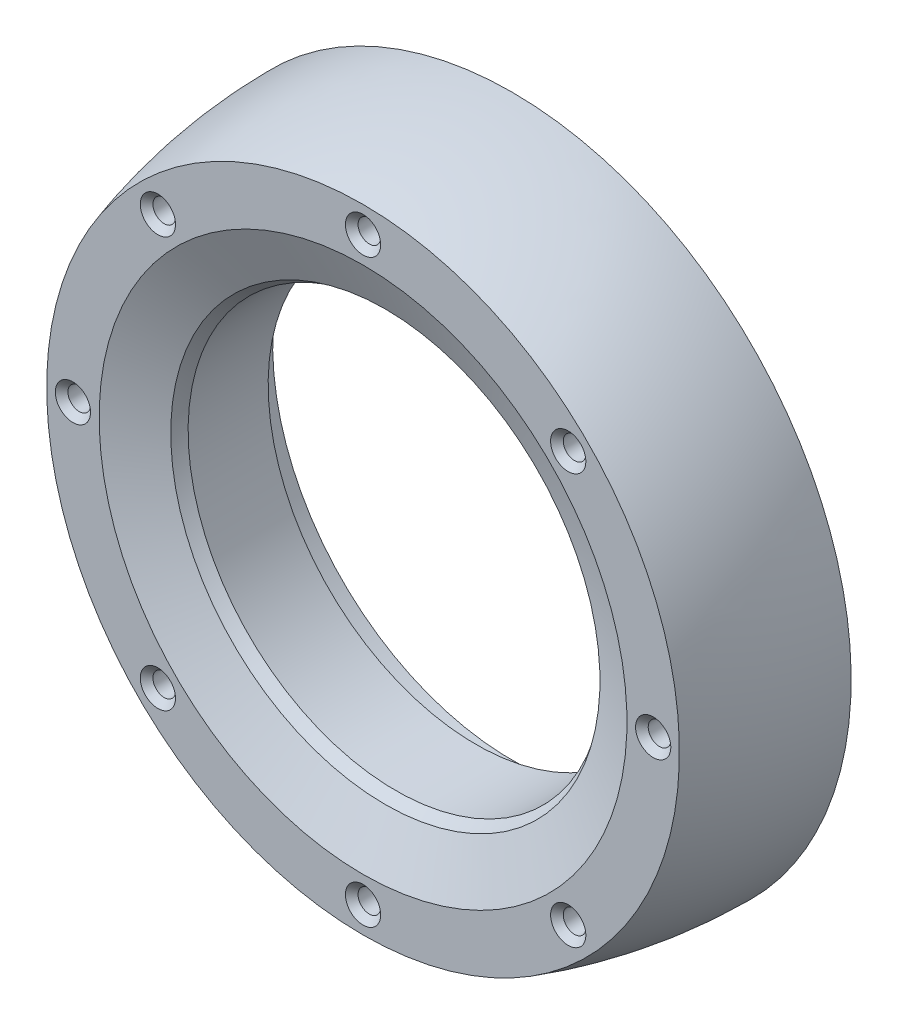
ISO-10303-21;
HEADER;
FILE_DESCRIPTION(('STEP AP214'),'2;1');
FILE_NAME('part.step','',(''),(''),'','','');
FILE_SCHEMA(('AUTOMOTIVE_DESIGN { 1 0 10303 214 1 1 1 1 }'));
ENDSEC;
DATA;
#1=APPLICATION_CONTEXT('core data for automotive mechanical design processes');
#2=APPLICATION_PROTOCOL_DEFINITION('international standard','automotive_design',2000,#1);
#3=PRODUCT_CONTEXT('',#1,'mechanical');
#4=PRODUCT('Part','Part','',(#3));
#5=PRODUCT_RELATED_PRODUCT_CATEGORY('part','',(#4));
#6=PRODUCT_DEFINITION_FORMATION('','',#4);
#7=PRODUCT_DEFINITION_CONTEXT('part definition',#1,'design');
#8=PRODUCT_DEFINITION('design','',#6,#7);
#9=PRODUCT_DEFINITION_SHAPE('','',#8);
#10=(LENGTH_UNIT() NAMED_UNIT(*) SI_UNIT(.MILLI.,.METRE.));
#11=(NAMED_UNIT(*) PLANE_ANGLE_UNIT() SI_UNIT($,.RADIAN.));
#12=(NAMED_UNIT(*) SI_UNIT($,.STERADIAN.) SOLID_ANGLE_UNIT());
#13=UNCERTAINTY_MEASURE_WITH_UNIT(LENGTH_MEASURE(1.E-05),#10,'distance_accuracy_value','');
#14=(GEOMETRIC_REPRESENTATION_CONTEXT(3) GLOBAL_UNCERTAINTY_ASSIGNED_CONTEXT((#13)) GLOBAL_UNIT_ASSIGNED_CONTEXT((#10,
#11,#12)) REPRESENTATION_CONTEXT('',''));
#15=CARTESIAN_POINT('',(0.,0.,0.));
#16=DIRECTION('',(0.,0.,1.));
#17=DIRECTION('',(1.,0.,0.));
#18=AXIS2_PLACEMENT_3D('',#15,#16,#17);
#19=CARTESIAN_POINT('',(0.,0.,16.5));
#20=DIRECTION('',(0.,0.,1.));
#21=DIRECTION('',(0.,-1.,0.));
#22=AXIS2_PLACEMENT_3D('',#19,#20,#21);
#23=PLANE('',#22);
#24=CARTESIAN_POINT('',(0.,-32.0981570979085,16.5));
#25=DIRECTION('',(0.,0.,1.));
#26=DIRECTION('',(1.,0.,0.));
#27=AXIS2_PLACEMENT_3D('',#24,#25,#26);
#28=CIRCLE('',#27,1.95);
#29=CARTESIAN_POINT('',(1.95,-32.0981570979085,16.5));
#30=VERTEX_POINT('',#29);
#31=EDGE_CURVE('E54',#30,#30,#28,.T.);
#32=ORIENTED_EDGE('',*,*,#31,.F.);
#33=EDGE_LOOP('',(#32));
#34=FACE_BOUND('',#33,.T.);
#35=CARTESIAN_POINT('',(-22.6968245475223,-22.6968245475222,16.5));
#36=DIRECTION('',(0.,0.,1.));
#37=DIRECTION('',(1.,0.,0.));
#38=AXIS2_PLACEMENT_3D('',#35,#36,#37);
#39=CIRCLE('',#38,1.95);
#40=CARTESIAN_POINT('',(-20.7468245475223,-22.6968245475222,16.5));
#41=VERTEX_POINT('',#40);
#42=EDGE_CURVE('E102',#41,#41,#39,.T.);
#43=ORIENTED_EDGE('',*,*,#42,.F.);
#44=EDGE_LOOP('',(#43));
#45=FACE_BOUND('',#44,.T.);
#46=CARTESIAN_POINT('',(-32.0981570979085,0.,16.5));
#47=DIRECTION('',(0.,0.,1.));
#48=DIRECTION('',(1.,0.,0.));
#49=AXIS2_PLACEMENT_3D('',#46,#47,#48);
#50=CIRCLE('',#49,1.95);
#51=CARTESIAN_POINT('',(-30.1481570979085,0.,16.5));
#52=VERTEX_POINT('',#51);
#53=EDGE_CURVE('E105',#52,#52,#50,.T.);
#54=ORIENTED_EDGE('',*,*,#53,.F.);
#55=EDGE_LOOP('',(#54));
#56=FACE_BOUND('',#55,.T.);
#57=CARTESIAN_POINT('',(-22.6968245475222,22.6968245475222,16.5));
#58=DIRECTION('',(0.,0.,1.));
#59=DIRECTION('',(1.,0.,0.));
#60=AXIS2_PLACEMENT_3D('',#57,#58,#59);
#61=CIRCLE('',#60,1.95);
#62=CARTESIAN_POINT('',(-20.7468245475222,22.6968245475222,16.5));
#63=VERTEX_POINT('',#62);
#64=EDGE_CURVE('E108',#63,#63,#61,.T.);
#65=ORIENTED_EDGE('',*,*,#64,.F.);
#66=EDGE_LOOP('',(#65));
#67=FACE_BOUND('',#66,.T.);
#68=CARTESIAN_POINT('',(0.,32.0981570979085,16.5));
#69=DIRECTION('',(0.,0.,1.));
#70=DIRECTION('',(1.,0.,0.));
#71=AXIS2_PLACEMENT_3D('',#68,#69,#70);
#72=CIRCLE('',#71,1.95);
#73=CARTESIAN_POINT('',(1.95,32.0981570979085,16.5));
#74=VERTEX_POINT('',#73);
#75=EDGE_CURVE('E111',#74,#74,#72,.T.);
#76=ORIENTED_EDGE('',*,*,#75,.F.);
#77=EDGE_LOOP('',(#76));
#78=FACE_BOUND('',#77,.T.);
#79=CARTESIAN_POINT('',(22.6968245475223,22.6968245475222,16.5));
#80=DIRECTION('',(0.,0.,1.));
#81=DIRECTION('',(1.,0.,0.));
#82=AXIS2_PLACEMENT_3D('',#79,#80,#81);
#83=CIRCLE('',#82,1.95);
#84=CARTESIAN_POINT('',(24.6468245475223,22.6968245475222,16.5));
#85=VERTEX_POINT('',#84);
#86=EDGE_CURVE('E114',#85,#85,#83,.T.);
#87=ORIENTED_EDGE('',*,*,#86,.F.);
#88=EDGE_LOOP('',(#87));
#89=FACE_BOUND('',#88,.T.);
#90=CARTESIAN_POINT('',(32.0981570979085,0.,16.5));
#91=DIRECTION('',(0.,0.,1.));
#92=DIRECTION('',(1.,0.,0.));
#93=AXIS2_PLACEMENT_3D('',#90,#91,#92);
#94=CIRCLE('',#93,1.95);
#95=CARTESIAN_POINT('',(34.0481570979085,0.,16.5));
#96=VERTEX_POINT('',#95);
#97=EDGE_CURVE('E117',#96,#96,#94,.T.);
#98=ORIENTED_EDGE('',*,*,#97,.F.);
#99=EDGE_LOOP('',(#98));
#100=FACE_BOUND('',#99,.T.);
#101=CARTESIAN_POINT('',(22.6968245475222,-22.6968245475223,16.5));
#102=DIRECTION('',(0.,0.,1.));
#103=DIRECTION('',(1.,0.,0.));
#104=AXIS2_PLACEMENT_3D('',#101,#102,#103);
#105=CIRCLE('',#104,1.95);
#106=CARTESIAN_POINT('',(24.6468245475222,-22.6968245475223,16.5));
#107=VERTEX_POINT('',#106);
#108=EDGE_CURVE('E120',#107,#107,#105,.T.);
#109=ORIENTED_EDGE('',*,*,#108,.F.);
#110=EDGE_LOOP('',(#109));
#111=FACE_BOUND('',#110,.T.);
#112=CARTESIAN_POINT('',(0.,0.,16.5));
#113=DIRECTION('',(0.,0.,1.));
#114=DIRECTION('',(0.,-1.,0.));
#115=AXIS2_PLACEMENT_3D('',#112,#113,#114);
#116=CIRCLE('',#115,29.196314195817);
#117=CARTESIAN_POINT('',(0.,-29.196314195817,16.5));
#118=VERTEX_POINT('',#117);
#119=EDGE_CURVE('E42',#118,#118,#116,.F.);
#120=ORIENTED_EDGE('',*,*,#119,.T.);
#121=EDGE_LOOP('',(#120));
#122=FACE_BOUND('',#121,.T.);
#123=CARTESIAN_POINT('',(0.,0.,16.5));
#124=DIRECTION('',(0.,0.,-1.));
#125=DIRECTION('',(0.,1.,0.));
#126=AXIS2_PLACEMENT_3D('',#123,#124,#125);
#127=CIRCLE('',#126,35.);
#128=CARTESIAN_POINT('',(0.,35.,16.5));
#129=VERTEX_POINT('',#128);
#130=EDGE_CURVE('E135',#129,#129,#127,.T.);
#131=ORIENTED_EDGE('',*,*,#130,.F.);
#132=EDGE_LOOP('',(#131));
#133=FACE_BOUND('',#132,.T.);
#134=ADVANCED_FACE('F34',(#34,#45,#56,#67,#78,#89,#100,#111,#122,#133),#23,.T.);
#135=CARTESIAN_POINT('',(0.,0.,22.5));
#136=DIRECTION('',(0.,0.,-1.));
#137=DIRECTION('',(0.,1.,0.));
#138=AXIS2_PLACEMENT_3D('',#135,#136,#137);
#139=DEGENERATE_TOROIDAL_SURFACE('',#138,9.,17.,.T.);
#140=CARTESIAN_POINT('',(0.,0.,12.8563492390071));
#141=DIRECTION('',(0.,0.,-1.));
#142=DIRECTION('',(0.,1.,0.));
#143=AXIS2_PLACEMENT_3D('',#140,#141,#142);
#144=CIRCLE('',#143,23.);
#145=CARTESIAN_POINT('',(0.,23.,12.8563492390071));
#146=VERTEX_POINT('',#145);
#147=EDGE_CURVE('E126',#146,#146,#144,.T.);
#148=ORIENTED_EDGE('',*,*,#147,.T.);
#149=EDGE_LOOP('',(#148));
#150=FACE_BOUND('',#149,.T.);
#151=CARTESIAN_POINT('',(0.,0.,14.0333791781715));
#152=DIRECTION('',(0.,0.,1.));
#153=DIRECTION('',(0.,-1.,0.));
#154=AXIS2_PLACEMENT_3D('',#151,#152,#153);
#155=CIRCLE('',#154,23.7416529554653);
#156=CARTESIAN_POINT('',(0.,-23.7416529554653,14.0333791781715));
#157=VERTEX_POINT('',#156);
#158=EDGE_CURVE('E10',#157,#157,#155,.T.);
#159=ORIENTED_EDGE('',*,*,#158,.T.);
#160=EDGE_LOOP('',(#159));
#161=FACE_BOUND('',#160,.T.);
#162=ADVANCED_FACE('F152',(#150,#161),#139,.F.);
#163=CARTESIAN_POINT('',(0.,0.,0.));
#164=DIRECTION('',(0.,0.,-1.));
#165=DIRECTION('',(0.,1.,0.));
#166=AXIS2_PLACEMENT_3D('',#163,#164,#165);
#167=PLANE('',#166);
#168=CARTESIAN_POINT('',(-22.6968245475223,-22.6968245475222,0.));
#169=DIRECTION('',(0.,0.,-1.));
#170=DIRECTION('',(0.,1.,0.));
#171=AXIS2_PLACEMENT_3D('',#168,#169,#170);
#172=CIRCLE('',#171,1.25);
#173=CARTESIAN_POINT('',(-22.6968245475223,-21.4468245475222,0.));
#174=VERTEX_POINT('',#173);
#175=EDGE_CURVE('E87',#174,#174,#172,.T.);
#176=ORIENTED_EDGE('',*,*,#175,.F.);
#177=EDGE_LOOP('',(#176));
#178=FACE_BOUND('',#177,.T.);
#179=CARTESIAN_POINT('',(0.,-32.0981570979085,0.));
#180=DIRECTION('',(0.,0.,-1.));
#181=DIRECTION('',(0.,1.,0.));
#182=AXIS2_PLACEMENT_3D('',#179,#180,#181);
#183=CIRCLE('',#182,1.25);
#184=CARTESIAN_POINT('',(0.,-30.8481570979085,0.));
#185=VERTEX_POINT('',#184);
#186=EDGE_CURVE('E77',#185,#185,#183,.T.);
#187=ORIENTED_EDGE('',*,*,#186,.F.);
#188=EDGE_LOOP('',(#187));
#189=FACE_BOUND('',#188,.T.);
#190=CARTESIAN_POINT('',(22.6968245475222,-22.6968245475223,0.));
#191=DIRECTION('',(0.,0.,-1.));
#192=DIRECTION('',(0.,1.,0.));
#193=AXIS2_PLACEMENT_3D('',#190,#191,#192);
#194=CIRCLE('',#193,1.25);
#195=CARTESIAN_POINT('',(22.6968245475222,-21.4468245475223,0.));
#196=VERTEX_POINT('',#195);
#197=EDGE_CURVE('E74',#196,#196,#194,.T.);
#198=ORIENTED_EDGE('',*,*,#197,.F.);
#199=EDGE_LOOP('',(#198));
#200=FACE_BOUND('',#199,.T.);
#201=CARTESIAN_POINT('',(32.0981570979085,0.,0.));
#202=DIRECTION('',(0.,0.,-1.));
#203=DIRECTION('',(0.,1.,0.));
#204=AXIS2_PLACEMENT_3D('',#201,#202,#203);
#205=CIRCLE('',#204,1.25);
#206=CARTESIAN_POINT('',(32.0981570979085,1.25,0.));
#207=VERTEX_POINT('',#206);
#208=EDGE_CURVE('E71',#207,#207,#205,.T.);
#209=ORIENTED_EDGE('',*,*,#208,.F.);
#210=EDGE_LOOP('',(#209));
#211=FACE_BOUND('',#210,.T.);
#212=CARTESIAN_POINT('',(22.6968245475223,22.6968245475222,0.));
#213=DIRECTION('',(0.,0.,-1.));
#214=DIRECTION('',(0.,1.,0.));
#215=AXIS2_PLACEMENT_3D('',#212,#213,#214);
#216=CIRCLE('',#215,1.25);
#217=CARTESIAN_POINT('',(22.6968245475223,23.9468245475222,0.));
#218=VERTEX_POINT('',#217);
#219=EDGE_CURVE('E67',#218,#218,#216,.T.);
#220=ORIENTED_EDGE('',*,*,#219,.F.);
#221=EDGE_LOOP('',(#220));
#222=FACE_BOUND('',#221,.T.);
#223=CARTESIAN_POINT('',(-32.0981570979085,0.,0.));
#224=DIRECTION('',(0.,0.,-1.));
#225=DIRECTION('',(0.,1.,0.));
#226=AXIS2_PLACEMENT_3D('',#223,#224,#225);
#227=CIRCLE('',#226,1.25);
#228=CARTESIAN_POINT('',(-32.0981570979085,1.25,0.));
#229=VERTEX_POINT('',#228);
#230=EDGE_CURVE('E63',#229,#229,#227,.T.);
#231=ORIENTED_EDGE('',*,*,#230,.F.);
#232=EDGE_LOOP('',(#231));
#233=FACE_BOUND('',#232,.T.);
#234=CARTESIAN_POINT('',(-22.6968245475222,22.6968245475222,0.));
#235=DIRECTION('',(0.,0.,-1.));
#236=DIRECTION('',(0.,1.,0.));
#237=AXIS2_PLACEMENT_3D('',#234,#235,#236);
#238=CIRCLE('',#237,1.25);
#239=CARTESIAN_POINT('',(-22.6968245475222,23.9468245475222,0.));
#240=VERTEX_POINT('',#239);
#241=EDGE_CURVE('E59',#240,#240,#238,.T.);
#242=ORIENTED_EDGE('',*,*,#241,.F.);
#243=EDGE_LOOP('',(#242));
#244=FACE_BOUND('',#243,.T.);
#245=CARTESIAN_POINT('',(0.,32.0981570979085,0.));
#246=DIRECTION('',(0.,0.,-1.));
#247=DIRECTION('',(0.,1.,0.));
#248=AXIS2_PLACEMENT_3D('',#245,#246,#247);
#249=CIRCLE('',#248,1.25);
#250=CARTESIAN_POINT('',(0.,33.3481570979085,0.));
#251=VERTEX_POINT('',#250);
#252=EDGE_CURVE('E55',#251,#251,#249,.T.);
#253=ORIENTED_EDGE('',*,*,#252,.F.);
#254=EDGE_LOOP('',(#253));
#255=FACE_BOUND('',#254,.T.);
#256=CARTESIAN_POINT('',(0.,0.,0.));
#257=DIRECTION('',(0.,0.,-1.));
#258=DIRECTION('',(0.,1.,0.));
#259=AXIS2_PLACEMENT_3D('',#256,#257,#258);
#260=CIRCLE('',#259,26.5);
#261=CARTESIAN_POINT('',(0.,26.5,0.));
#262=VERTEX_POINT('',#261);
#263=EDGE_CURVE('E129',#262,#262,#260,.T.);
#264=ORIENTED_EDGE('',*,*,#263,.F.);
#265=EDGE_LOOP('',(#264));
#266=FACE_BOUND('',#265,.T.);
#267=CARTESIAN_POINT('',(0.,0.,0.));
#268=DIRECTION('',(0.,0.,-1.));
#269=DIRECTION('',(0.,1.,0.));
#270=AXIS2_PLACEMENT_3D('',#267,#268,#269);
#271=CIRCLE('',#270,37.5);
#272=CARTESIAN_POINT('',(0.,37.5,0.));
#273=VERTEX_POINT('',#272);
#274=EDGE_CURVE('E47',#273,#273,#271,.T.);
#275=ORIENTED_EDGE('',*,*,#274,.T.);
#276=EDGE_LOOP('',(#275));
#277=FACE_BOUND('',#276,.T.);
#278=ADVANCED_FACE('F140',(#178,#189,#200,#211,#222,#233,#244,#255,#266,#277),#167,.T.);
#279=CARTESIAN_POINT('',(0.,0.,0.));
#280=DIRECTION('',(0.,0.,-1.));
#281=DIRECTION('',(0.,1.,0.));
#282=AXIS2_PLACEMENT_3D('',#279,#280,#281);
#283=DEGENERATE_TOROIDAL_SURFACE('',#282,18.2000000000001,55.7000000000001,.F.);
#284=ORIENTED_EDGE('',*,*,#130,.T.);
#285=EDGE_LOOP('',(#284));
#286=FACE_BOUND('',#285,.T.);
#287=ORIENTED_EDGE('',*,*,#274,.F.);
#288=EDGE_LOOP('',(#287));
#289=FACE_BOUND('',#288,.T.);
#290=ADVANCED_FACE('F142',(#286,#289),#283,.F.);
#291=CARTESIAN_POINT('',(0.,0.,16.5));
#292=DIRECTION('',(0.,0.,1.));
#293=DIRECTION('',(0.,-1.,0.));
#294=AXIS2_PLACEMENT_3D('',#291,#292,#293);
#295=CONICAL_SURFACE('',#294,29.196314195817,1.14611088376097);
#296=ORIENTED_EDGE('',*,*,#158,.F.);
#297=EDGE_LOOP('',(#296));
#298=FACE_BOUND('',#297,.T.);
#299=ORIENTED_EDGE('',*,*,#119,.F.);
#300=EDGE_LOOP('',(#299));
#301=FACE_BOUND('',#300,.T.);
#302=ADVANCED_FACE('F36',(#298,#301),#295,.F.);
#303=CARTESIAN_POINT('',(0.,0.,-11.0117281202219));
#304=DIRECTION('',(0.,0.,-1.));
#305=DIRECTION('',(0.,1.,0.));
#306=AXIS2_PLACEMENT_3D('',#303,#304,#305);
#307=CYLINDRICAL_SURFACE('',#306,26.5);
#308=CARTESIAN_POINT('',(0.,0.,3.99999999999999));
#309=DIRECTION('',(0.,0.,-1.));
#310=DIRECTION('',(0.,1.,0.));
#311=AXIS2_PLACEMENT_3D('',#308,#309,#310);
#312=CIRCLE('',#311,26.5);
#313=CARTESIAN_POINT('',(0.,26.5,3.99999999999999));
#314=VERTEX_POINT('',#313);
#315=EDGE_CURVE('E132',#314,#314,#312,.T.);
#316=ORIENTED_EDGE('',*,*,#315,.F.);
#317=EDGE_LOOP('',(#316));
#318=FACE_BOUND('',#317,.T.);
#319=ORIENTED_EDGE('',*,*,#263,.T.);
#320=EDGE_LOOP('',(#319));
#321=FACE_BOUND('',#320,.T.);
#322=ADVANCED_FACE('F150',(#318,#321),#307,.F.);
#323=CARTESIAN_POINT('',(0.,0.,4.));
#324=DIRECTION('',(0.,0.,1.));
#325=DIRECTION('',(0.,-1.,0.));
#326=AXIS2_PLACEMENT_3D('',#323,#324,#325);
#327=PLANE('',#326);
#328=CARTESIAN_POINT('',(0.,0.,3.99999999999999));
#329=DIRECTION('',(0.,0.,-1.));
#330=DIRECTION('',(0.,1.,0.));
#331=AXIS2_PLACEMENT_3D('',#328,#329,#330);
#332=CIRCLE('',#331,23.);
#333=CARTESIAN_POINT('',(0.,23.,3.99999999999999));
#334=VERTEX_POINT('',#333);
#335=EDGE_CURVE('E123',#334,#334,#332,.T.);
#336=ORIENTED_EDGE('',*,*,#335,.F.);
#337=EDGE_LOOP('',(#336));
#338=FACE_BOUND('',#337,.T.);
#339=ORIENTED_EDGE('',*,*,#315,.T.);
#340=EDGE_LOOP('',(#339));
#341=FACE_BOUND('',#340,.T.);
#342=ADVANCED_FACE('F166',(#338,#341),#327,.F.);
#343=CARTESIAN_POINT('',(0.,0.,-11.0117281202219));
#344=DIRECTION('',(0.,0.,-1.));
#345=DIRECTION('',(0.,1.,0.));
#346=AXIS2_PLACEMENT_3D('',#343,#344,#345);
#347=CYLINDRICAL_SURFACE('',#346,23.);
#348=ORIENTED_EDGE('',*,*,#147,.F.);
#349=EDGE_LOOP('',(#348));
#350=FACE_BOUND('',#349,.T.);
#351=ORIENTED_EDGE('',*,*,#335,.T.);
#352=EDGE_LOOP('',(#351));
#353=FACE_BOUND('',#352,.T.);
#354=ADVANCED_FACE('F168',(#350,#353),#347,.F.);
#355=CARTESIAN_POINT('',(22.6968245475222,-22.6968245475223,16.5));
#356=DIRECTION('',(0.,0.,1.));
#357=DIRECTION('',(1.,0.,0.));
#358=AXIS2_PLACEMENT_3D('',#355,#356,#357);
#359=CONICAL_SURFACE('',#358,1.95,0.785398163397448);
#360=CARTESIAN_POINT('',(22.6968245475222,-22.6968245475223,15.8));
#361=DIRECTION('',(0.,0.,1.));
#362=DIRECTION('',(1.,0.,0.));
#363=AXIS2_PLACEMENT_3D('',#360,#361,#362);
#364=CIRCLE('',#363,1.25);
#365=CARTESIAN_POINT('',(23.9468245475222,-22.6968245475223,15.8));
#366=VERTEX_POINT('',#365);
#367=EDGE_CURVE('E72',#366,#366,#364,.F.);
#368=ORIENTED_EDGE('',*,*,#367,.T.);
#369=EDGE_LOOP('',(#368));
#370=FACE_BOUND('',#369,.T.);
#371=ORIENTED_EDGE('',*,*,#108,.T.);
#372=EDGE_LOOP('',(#371));
#373=FACE_BOUND('',#372,.T.);
#374=ADVANCED_FACE('F174',(#370,#373),#359,.F.);
#375=CARTESIAN_POINT('',(32.0981570979085,0.,16.5));
#376=DIRECTION('',(0.,0.,1.));
#377=DIRECTION('',(1.,0.,0.));
#378=AXIS2_PLACEMENT_3D('',#375,#376,#377);
#379=CONICAL_SURFACE('',#378,1.95,0.78539816339745);
#380=CARTESIAN_POINT('',(32.0981570979085,0.,15.8));
#381=DIRECTION('',(0.,0.,1.));
#382=DIRECTION('',(1.,0.,0.));
#383=AXIS2_PLACEMENT_3D('',#380,#381,#382);
#384=CIRCLE('',#383,1.25);
#385=CARTESIAN_POINT('',(33.3481570979085,0.,15.8));
#386=VERTEX_POINT('',#385);
#387=EDGE_CURVE('E68',#386,#386,#384,.F.);
#388=ORIENTED_EDGE('',*,*,#387,.T.);
#389=EDGE_LOOP('',(#388));
#390=FACE_BOUND('',#389,.T.);
#391=ORIENTED_EDGE('',*,*,#97,.T.);
#392=EDGE_LOOP('',(#391));
#393=FACE_BOUND('',#392,.T.);
#394=ADVANCED_FACE('F190',(#390,#393),#379,.F.);
#395=CARTESIAN_POINT('',(22.6968245475223,22.6968245475222,16.5));
#396=DIRECTION('',(0.,0.,1.));
#397=DIRECTION('',(1.,0.,0.));
#398=AXIS2_PLACEMENT_3D('',#395,#396,#397);
#399=CONICAL_SURFACE('',#398,1.95,0.785398163397448);
#400=CARTESIAN_POINT('',(22.6968245475223,22.6968245475222,15.8));
#401=DIRECTION('',(0.,0.,1.));
#402=DIRECTION('',(1.,0.,0.));
#403=AXIS2_PLACEMENT_3D('',#400,#401,#402);
#404=CIRCLE('',#403,1.25);
#405=CARTESIAN_POINT('',(23.9468245475223,22.6968245475222,15.8));
#406=VERTEX_POINT('',#405);
#407=EDGE_CURVE('E64',#406,#406,#404,.F.);
#408=ORIENTED_EDGE('',*,*,#407,.T.);
#409=EDGE_LOOP('',(#408));
#410=FACE_BOUND('',#409,.T.);
#411=ORIENTED_EDGE('',*,*,#86,.T.);
#412=EDGE_LOOP('',(#411));
#413=FACE_BOUND('',#412,.T.);
#414=ADVANCED_FACE('F194',(#410,#413),#399,.F.);
#415=CARTESIAN_POINT('',(0.,32.0981570979085,16.5));
#416=DIRECTION('',(0.,0.,1.));
#417=DIRECTION('',(1.,0.,0.));
#418=AXIS2_PLACEMENT_3D('',#415,#416,#417);
#419=CONICAL_SURFACE('',#418,1.95,0.785398163397449);
#420=CARTESIAN_POINT('',(0.,32.0981570979085,15.8));
#421=DIRECTION('',(0.,0.,1.));
#422=DIRECTION('',(1.,0.,0.));
#423=AXIS2_PLACEMENT_3D('',#420,#421,#422);
#424=CIRCLE('',#423,1.25);
#425=CARTESIAN_POINT('',(1.25,32.0981570979085,15.8));
#426=VERTEX_POINT('',#425);
#427=EDGE_CURVE('E51',#426,#426,#424,.F.);
#428=ORIENTED_EDGE('',*,*,#427,.T.);
#429=EDGE_LOOP('',(#428));
#430=FACE_BOUND('',#429,.T.);
#431=ORIENTED_EDGE('',*,*,#75,.T.);
#432=EDGE_LOOP('',(#431));
#433=FACE_BOUND('',#432,.T.);
#434=ADVANCED_FACE('F198',(#430,#433),#419,.F.);
#435=CARTESIAN_POINT('',(-22.6968245475222,22.6968245475222,16.5));
#436=DIRECTION('',(0.,0.,1.));
#437=DIRECTION('',(1.,0.,0.));
#438=AXIS2_PLACEMENT_3D('',#435,#436,#437);
#439=CONICAL_SURFACE('',#438,1.95,0.785398163397448);
#440=CARTESIAN_POINT('',(-22.6968245475222,22.6968245475222,15.8));
#441=DIRECTION('',(0.,0.,1.));
#442=DIRECTION('',(1.,0.,0.));
#443=AXIS2_PLACEMENT_3D('',#440,#441,#442);
#444=CIRCLE('',#443,1.25);
#445=CARTESIAN_POINT('',(-21.4468245475222,22.6968245475222,15.8));
#446=VERTEX_POINT('',#445);
#447=EDGE_CURVE('E56',#446,#446,#444,.F.);
#448=ORIENTED_EDGE('',*,*,#447,.T.);
#449=EDGE_LOOP('',(#448));
#450=FACE_BOUND('',#449,.T.);
#451=ORIENTED_EDGE('',*,*,#64,.T.);
#452=EDGE_LOOP('',(#451));
#453=FACE_BOUND('',#452,.T.);
#454=ADVANCED_FACE('F202',(#450,#453),#439,.F.);
#455=CARTESIAN_POINT('',(-32.0981570979085,0.,16.5));
#456=DIRECTION('',(0.,0.,1.));
#457=DIRECTION('',(1.,0.,0.));
#458=AXIS2_PLACEMENT_3D('',#455,#456,#457);
#459=CONICAL_SURFACE('',#458,1.95,0.78539816339745);
#460=CARTESIAN_POINT('',(-32.0981570979085,0.,15.8));
#461=DIRECTION('',(0.,0.,1.));
#462=DIRECTION('',(1.,0.,0.));
#463=AXIS2_PLACEMENT_3D('',#460,#461,#462);
#464=CIRCLE('',#463,1.25);
#465=CARTESIAN_POINT('',(-30.8481570979085,0.,15.8));
#466=VERTEX_POINT('',#465);
#467=EDGE_CURVE('E60',#466,#466,#464,.F.);
#468=ORIENTED_EDGE('',*,*,#467,.T.);
#469=EDGE_LOOP('',(#468));
#470=FACE_BOUND('',#469,.T.);
#471=ORIENTED_EDGE('',*,*,#53,.T.);
#472=EDGE_LOOP('',(#471));
#473=FACE_BOUND('',#472,.T.);
#474=ADVANCED_FACE('F206',(#470,#473),#459,.F.);
#475=CARTESIAN_POINT('',(-22.6968245475223,-22.6968245475222,16.5));
#476=DIRECTION('',(0.,0.,1.));
#477=DIRECTION('',(1.,0.,0.));
#478=AXIS2_PLACEMENT_3D('',#475,#476,#477);
#479=CONICAL_SURFACE('',#478,1.95,0.785398163397448);
#480=CARTESIAN_POINT('',(-22.6968245475223,-22.6968245475222,15.8));
#481=DIRECTION('',(0.,0.,1.));
#482=DIRECTION('',(1.,0.,0.));
#483=AXIS2_PLACEMENT_3D('',#480,#481,#482);
#484=CIRCLE('',#483,1.25);
#485=CARTESIAN_POINT('',(-21.4468245475223,-22.6968245475222,15.8));
#486=VERTEX_POINT('',#485);
#487=EDGE_CURVE('E38',#486,#486,#484,.F.);
#488=ORIENTED_EDGE('',*,*,#487,.T.);
#489=EDGE_LOOP('',(#488));
#490=FACE_BOUND('',#489,.T.);
#491=ORIENTED_EDGE('',*,*,#42,.T.);
#492=EDGE_LOOP('',(#491));
#493=FACE_BOUND('',#492,.T.);
#494=ADVANCED_FACE('F210',(#490,#493),#479,.F.);
#495=CARTESIAN_POINT('',(0.,-32.0981570979085,16.5));
#496=DIRECTION('',(0.,0.,1.));
#497=DIRECTION('',(1.,0.,0.));
#498=AXIS2_PLACEMENT_3D('',#495,#496,#497);
#499=CONICAL_SURFACE('',#498,1.95,0.785398163397449);
#500=CARTESIAN_POINT('',(0.,-32.0981570979085,15.8));
#501=DIRECTION('',(0.,0.,1.));
#502=DIRECTION('',(1.,0.,0.));
#503=AXIS2_PLACEMENT_3D('',#500,#501,#502);
#504=CIRCLE('',#503,1.25);
#505=CARTESIAN_POINT('',(1.25,-32.0981570979085,15.8));
#506=VERTEX_POINT('',#505);
#507=EDGE_CURVE('E75',#506,#506,#504,.F.);
#508=ORIENTED_EDGE('',*,*,#507,.T.);
#509=EDGE_LOOP('',(#508));
#510=FACE_BOUND('',#509,.T.);
#511=ORIENTED_EDGE('',*,*,#31,.T.);
#512=EDGE_LOOP('',(#511));
#513=FACE_BOUND('',#512,.T.);
#514=ADVANCED_FACE('F214',(#510,#513),#499,.F.);
#515=CARTESIAN_POINT('',(0.,32.0981570979085,16.5));
#516=DIRECTION('',(0.,0.,-1.));
#517=DIRECTION('',(0.,1.,0.));
#518=AXIS2_PLACEMENT_3D('',#515,#516,#517);
#519=CYLINDRICAL_SURFACE('',#518,1.25);
#520=ORIENTED_EDGE('',*,*,#252,.T.);
#521=EDGE_LOOP('',(#520));
#522=FACE_BOUND('',#521,.T.);
#523=ORIENTED_EDGE('',*,*,#427,.F.);
#524=EDGE_LOOP('',(#523));
#525=FACE_BOUND('',#524,.T.);
#526=ADVANCED_FACE('F218',(#522,#525),#519,.F.);
#527=CARTESIAN_POINT('',(-22.6968245475222,22.6968245475222,16.5));
#528=DIRECTION('',(0.,0.,-1.));
#529=DIRECTION('',(0.,1.,0.));
#530=AXIS2_PLACEMENT_3D('',#527,#528,#529);
#531=CYLINDRICAL_SURFACE('',#530,1.25);
#532=ORIENTED_EDGE('',*,*,#241,.T.);
#533=EDGE_LOOP('',(#532));
#534=FACE_BOUND('',#533,.T.);
#535=ORIENTED_EDGE('',*,*,#447,.F.);
#536=EDGE_LOOP('',(#535));
#537=FACE_BOUND('',#536,.T.);
#538=ADVANCED_FACE('F221',(#534,#537),#531,.F.);
#539=CARTESIAN_POINT('',(-32.0981570979085,0.,16.5));
#540=DIRECTION('',(0.,0.,-1.));
#541=DIRECTION('',(0.,1.,0.));
#542=AXIS2_PLACEMENT_3D('',#539,#540,#541);
#543=CYLINDRICAL_SURFACE('',#542,1.25);
#544=ORIENTED_EDGE('',*,*,#230,.T.);
#545=EDGE_LOOP('',(#544));
#546=FACE_BOUND('',#545,.T.);
#547=ORIENTED_EDGE('',*,*,#467,.F.);
#548=EDGE_LOOP('',(#547));
#549=FACE_BOUND('',#548,.T.);
#550=ADVANCED_FACE('F225',(#546,#549),#543,.F.);
#551=CARTESIAN_POINT('',(22.6968245475223,22.6968245475222,16.5));
#552=DIRECTION('',(0.,0.,-1.));
#553=DIRECTION('',(0.,1.,0.));
#554=AXIS2_PLACEMENT_3D('',#551,#552,#553);
#555=CYLINDRICAL_SURFACE('',#554,1.25);
#556=ORIENTED_EDGE('',*,*,#219,.T.);
#557=EDGE_LOOP('',(#556));
#558=FACE_BOUND('',#557,.T.);
#559=ORIENTED_EDGE('',*,*,#407,.F.);
#560=EDGE_LOOP('',(#559));
#561=FACE_BOUND('',#560,.T.);
#562=ADVANCED_FACE('F229',(#558,#561),#555,.F.);
#563=CARTESIAN_POINT('',(32.0981570979085,0.,16.5));
#564=DIRECTION('',(0.,0.,-1.));
#565=DIRECTION('',(0.,1.,0.));
#566=AXIS2_PLACEMENT_3D('',#563,#564,#565);
#567=CYLINDRICAL_SURFACE('',#566,1.25);
#568=ORIENTED_EDGE('',*,*,#208,.T.);
#569=EDGE_LOOP('',(#568));
#570=FACE_BOUND('',#569,.T.);
#571=ORIENTED_EDGE('',*,*,#387,.F.);
#572=EDGE_LOOP('',(#571));
#573=FACE_BOUND('',#572,.T.);
#574=ADVANCED_FACE('F233',(#570,#573),#567,.F.);
#575=CARTESIAN_POINT('',(22.6968245475222,-22.6968245475223,16.5));
#576=DIRECTION('',(0.,0.,-1.));
#577=DIRECTION('',(0.,1.,0.));
#578=AXIS2_PLACEMENT_3D('',#575,#576,#577);
#579=CYLINDRICAL_SURFACE('',#578,1.25);
#580=ORIENTED_EDGE('',*,*,#197,.T.);
#581=EDGE_LOOP('',(#580));
#582=FACE_BOUND('',#581,.T.);
#583=ORIENTED_EDGE('',*,*,#367,.F.);
#584=EDGE_LOOP('',(#583));
#585=FACE_BOUND('',#584,.T.);
#586=ADVANCED_FACE('F237',(#582,#585),#579,.F.);
#587=CARTESIAN_POINT('',(0.,-32.0981570979085,16.5));
#588=DIRECTION('',(0.,0.,-1.));
#589=DIRECTION('',(0.,1.,0.));
#590=AXIS2_PLACEMENT_3D('',#587,#588,#589);
#591=CYLINDRICAL_SURFACE('',#590,1.25);
#592=ORIENTED_EDGE('',*,*,#186,.T.);
#593=EDGE_LOOP('',(#592));
#594=FACE_BOUND('',#593,.T.);
#595=ORIENTED_EDGE('',*,*,#507,.F.);
#596=EDGE_LOOP('',(#595));
#597=FACE_BOUND('',#596,.T.);
#598=ADVANCED_FACE('F241',(#594,#597),#591,.F.);
#599=CARTESIAN_POINT('',(-22.6968245475223,-22.6968245475222,16.5));
#600=DIRECTION('',(0.,0.,-1.));
#601=DIRECTION('',(0.,1.,0.));
#602=AXIS2_PLACEMENT_3D('',#599,#600,#601);
#603=CYLINDRICAL_SURFACE('',#602,1.25);
#604=ORIENTED_EDGE('',*,*,#175,.T.);
#605=EDGE_LOOP('',(#604));
#606=FACE_BOUND('',#605,.T.);
#607=ORIENTED_EDGE('',*,*,#487,.F.);
#608=EDGE_LOOP('',(#607));
#609=FACE_BOUND('',#608,.T.);
#610=ADVANCED_FACE('F245',(#606,#609),#603,.F.);
#611=CLOSED_SHELL('',(#134,#162,#278,#290,#302,#322,#342,#354,#374,#394,#414,#434,#454,#474,
#494,#514,#526,#538,#550,#562,#574,#586,#598,#610));
#612=MANIFOLD_SOLID_BREP('B2',#611);
#613=ADVANCED_BREP_SHAPE_REPRESENTATION('',(#18,#612),#14);
#614=SHAPE_DEFINITION_REPRESENTATION(#9,#613);
ENDSEC;
END-ISO-10303-21;
